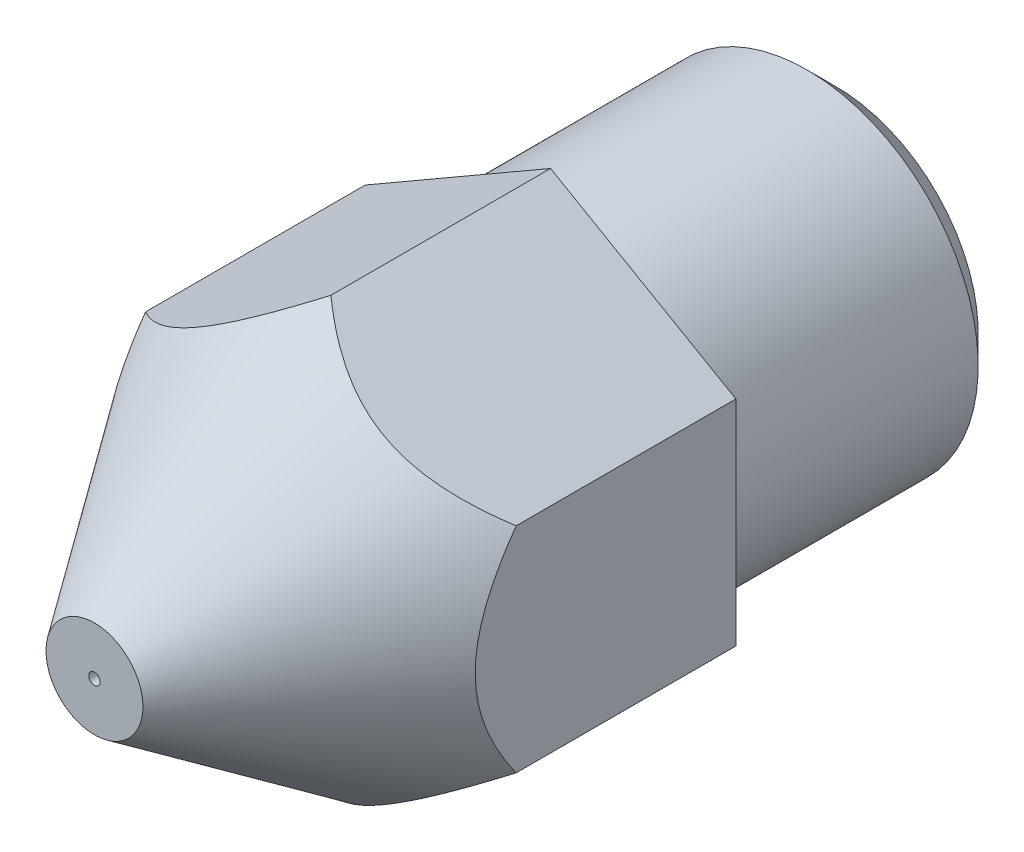
ISO-10303-21;
HEADER;
FILE_DESCRIPTION(('STEP AP214'),'2;1');
FILE_NAME('part.step','',(''),(''),'','','');
FILE_SCHEMA(('AUTOMOTIVE_DESIGN { 1 0 10303 214 1 1 1 1 }'));
ENDSEC;
DATA;
#1=APPLICATION_CONTEXT('core data for automotive mechanical design processes');
#2=APPLICATION_PROTOCOL_DEFINITION('international standard','automotive_design',2000,#1);
#3=PRODUCT_CONTEXT('',#1,'mechanical');
#4=PRODUCT('Part','Part','',(#3));
#5=PRODUCT_RELATED_PRODUCT_CATEGORY('part','',(#4));
#6=PRODUCT_DEFINITION_FORMATION('','',#4);
#7=PRODUCT_DEFINITION_CONTEXT('part definition',#1,'design');
#8=PRODUCT_DEFINITION('design','',#6,#7);
#9=PRODUCT_DEFINITION_SHAPE('','',#8);
#10=(LENGTH_UNIT() NAMED_UNIT(*) SI_UNIT(.MILLI.,.METRE.));
#11=(NAMED_UNIT(*) PLANE_ANGLE_UNIT() SI_UNIT($,.RADIAN.));
#12=(NAMED_UNIT(*) SI_UNIT($,.STERADIAN.) SOLID_ANGLE_UNIT());
#13=UNCERTAINTY_MEASURE_WITH_UNIT(LENGTH_MEASURE(1.E-05),#10,'distance_accuracy_value','');
#14=(GEOMETRIC_REPRESENTATION_CONTEXT(3) GLOBAL_UNCERTAINTY_ASSIGNED_CONTEXT((#13)) GLOBAL_UNIT_ASSIGNED_CONTEXT((#10,
#11,#12)) REPRESENTATION_CONTEXT('',''));
#15=CARTESIAN_POINT('',(0.,0.,0.));
#16=DIRECTION('',(0.,0.,1.));
#17=DIRECTION('',(1.,0.,0.));
#18=AXIS2_PLACEMENT_3D('',#15,#16,#17);
#19=CARTESIAN_POINT('',(-8.72088259015655,0.,-3.5));
#20=DIRECTION('',(0.,0.,-1.));
#21=DIRECTION('',(-1.,0.,0.));
#22=AXIS2_PLACEMENT_3D('',#19,#20,#21);
#23=PLANE('',#22);
#24=CARTESIAN_POINT('',(0.,0.,-3.5));
#25=DIRECTION('',(0.,0.,-1.));
#26=DIRECTION('',(-1.,0.,0.));
#27=AXIS2_PLACEMENT_3D('',#24,#25,#26);
#28=CIRCLE('',#27,3.);
#29=CARTESIAN_POINT('',(-3.,0.,-3.5));
#30=VERTEX_POINT('',#29);
#31=EDGE_CURVE('E178',#30,#30,#28,.T.);
#32=ORIENTED_EDGE('',*,*,#31,.F.);
#33=EDGE_LOOP('',(#32));
#34=FACE_BOUND('',#33,.T.);
#35=DIRECTION('',(0.866025403784438,-0.500000000000001,0.));
#36=VECTOR('',#35,1.);
#37=CARTESIAN_POINT('',(3.25,1.87638837486627,-3.5));
#38=LINE('',#37,#36);
#39=CARTESIAN_POINT('',(0.,3.75277674973256,-3.5));
#40=VERTEX_POINT('',#39);
#41=CARTESIAN_POINT('',(3.25,1.87638837486627,-3.5));
#42=VERTEX_POINT('',#41);
#43=EDGE_CURVE('E120',#40,#42,#38,.T.);
#44=ORIENTED_EDGE('',*,*,#43,.T.);
#45=DIRECTION('',(0.,-1.,0.));
#46=VECTOR('',#45,1.);
#47=CARTESIAN_POINT('',(3.25,1.87638837486627,-3.5));
#48=LINE('',#47,#46);
#49=CARTESIAN_POINT('',(3.25,-1.87638837486629,-3.5));
#50=VERTEX_POINT('',#49);
#51=EDGE_CURVE('E115',#42,#50,#48,.T.);
#52=ORIENTED_EDGE('',*,*,#51,.T.);
#53=DIRECTION('',(-0.866025403784439,-0.499999999999998,0.));
#54=VECTOR('',#53,1.);
#55=CARTESIAN_POINT('',(3.25,-1.87638837486629,-3.5));
#56=LINE('',#55,#54);
#57=CARTESIAN_POINT('',(0.,-3.75277674973256,-3.5));
#58=VERTEX_POINT('',#57);
#59=EDGE_CURVE('E113',#50,#58,#56,.T.);
#60=ORIENTED_EDGE('',*,*,#59,.T.);
#61=DIRECTION('',(-0.866025403784439,0.499999999999998,0.));
#62=VECTOR('',#61,1.);
#63=CARTESIAN_POINT('',(-3.25,-1.87638837486629,-3.5));
#64=LINE('',#63,#62);
#65=CARTESIAN_POINT('',(-3.25,-1.87638837486629,-3.5));
#66=VERTEX_POINT('',#65);
#67=EDGE_CURVE('E62',#58,#66,#64,.T.);
#68=ORIENTED_EDGE('',*,*,#67,.T.);
#69=DIRECTION('',(0.,1.,0.));
#70=VECTOR('',#69,1.);
#71=CARTESIAN_POINT('',(-3.25,1.87638837486627,-3.5));
#72=LINE('',#71,#70);
#73=CARTESIAN_POINT('',(-3.25,1.87638837486627,-3.5));
#74=VERTEX_POINT('',#73);
#75=EDGE_CURVE('E102',#66,#74,#72,.T.);
#76=ORIENTED_EDGE('',*,*,#75,.T.);
#77=DIRECTION('',(0.866025403784438,0.500000000000001,0.));
#78=VECTOR('',#77,1.);
#79=CARTESIAN_POINT('',(-3.25,1.87638837486627,-3.5));
#80=LINE('',#79,#78);
#81=EDGE_CURVE('E108',#74,#40,#80,.T.);
#82=ORIENTED_EDGE('',*,*,#81,.T.);
#83=EDGE_LOOP('',(#44,#52,#60,#68,#76,#82));
#84=FACE_BOUND('',#83,.T.);
#85=ADVANCED_FACE('F39',(#34,#84),#23,.T.);
#86=CARTESIAN_POINT('',(0.,0.,0.));
#87=DIRECTION('',(0.,0.,-1.));
#88=DIRECTION('',(-1.,0.,0.));
#89=AXIS2_PLACEMENT_3D('',#86,#87,#88);
#90=CYLINDRICAL_SURFACE('',#89,3.);
#91=CARTESIAN_POINT('',(0.,0.,-8.));
#92=DIRECTION('',(0.,0.,-1.));
#93=DIRECTION('',(-1.,0.,0.));
#94=AXIS2_PLACEMENT_3D('',#91,#92,#93);
#95=CIRCLE('',#94,3.);
#96=CARTESIAN_POINT('',(-3.,0.,-8.));
#97=VERTEX_POINT('',#96);
#98=EDGE_CURVE('E11',#97,#97,#95,.F.);
#99=ORIENTED_EDGE('',*,*,#98,.T.);
#100=EDGE_LOOP('',(#99));
#101=FACE_BOUND('',#100,.T.);
#102=ORIENTED_EDGE('',*,*,#31,.T.);
#103=EDGE_LOOP('',(#102));
#104=FACE_BOUND('',#103,.T.);
#105=ADVANCED_FACE('F201',(#101,#104),#90,.T.);
#106=CARTESIAN_POINT('',(-8.72088259015655,0.,-8.5));
#107=DIRECTION('',(0.,0.,-1.));
#108=DIRECTION('',(-1.,0.,0.));
#109=AXIS2_PLACEMENT_3D('',#106,#107,#108);
#110=PLANE('',#109);
#111=CARTESIAN_POINT('',(0.,0.,-8.5));
#112=DIRECTION('',(0.,0.,-1.));
#113=DIRECTION('',(-1.,0.,0.));
#114=AXIS2_PLACEMENT_3D('',#111,#112,#113);
#115=CIRCLE('',#114,2.5);
#116=CARTESIAN_POINT('',(-2.5,0.,-8.5));
#117=VERTEX_POINT('',#116);
#118=EDGE_CURVE('E47',#117,#117,#115,.T.);
#119=ORIENTED_EDGE('',*,*,#118,.T.);
#120=EDGE_LOOP('',(#119));
#121=FACE_BOUND('',#120,.T.);
#122=CARTESIAN_POINT('',(0.,0.,-8.5));
#123=DIRECTION('',(0.,0.,-1.));
#124=DIRECTION('',(-1.,0.,0.));
#125=AXIS2_PLACEMENT_3D('',#122,#123,#124);
#126=CIRCLE('',#125,0.999999999999999);
#127=CARTESIAN_POINT('',(-0.999999999999999,0.,-8.5));
#128=VERTEX_POINT('',#127);
#129=EDGE_CURVE('E175',#128,#128,#126,.T.);
#130=ORIENTED_EDGE('',*,*,#129,.F.);
#131=EDGE_LOOP('',(#130));
#132=FACE_BOUND('',#131,.T.);
#133=ADVANCED_FACE('F186',(#121,#132),#110,.T.);
#134=CARTESIAN_POINT('',(0.,0.,0.));
#135=DIRECTION('',(0.,0.,-1.));
#136=DIRECTION('',(-1.,0.,0.));
#137=AXIS2_PLACEMENT_3D('',#134,#135,#136);
#138=CYLINDRICAL_SURFACE('',#137,0.999999999999999);
#139=CARTESIAN_POINT('',(0.,0.,1.7679491924311));
#140=DIRECTION('',(0.,0.,-1.));
#141=DIRECTION('',(-1.,0.,0.));
#142=AXIS2_PLACEMENT_3D('',#139,#140,#141);
#143=CIRCLE('',#142,1.);
#144=CARTESIAN_POINT('',(-1.,0.,1.7679491924311));
#145=VERTEX_POINT('',#144);
#146=EDGE_CURVE('E166',#145,#145,#143,.T.);
#147=ORIENTED_EDGE('',*,*,#146,.F.);
#148=EDGE_LOOP('',(#147));
#149=FACE_BOUND('',#148,.T.);
#150=ORIENTED_EDGE('',*,*,#129,.T.);
#151=EDGE_LOOP('',(#150));
#152=FACE_BOUND('',#151,.T.);
#153=ADVANCED_FACE('F211',(#149,#152),#138,.F.);
#154=CARTESIAN_POINT('',(0.,0.,3.5));
#155=DIRECTION('',(0.,0.,-1.));
#156=DIRECTION('',(-1.,0.,0.));
#157=AXIS2_PLACEMENT_3D('',#154,#155,#156);
#158=CONICAL_SURFACE('',#157,0.,0.523598775598292);
#159=CARTESIAN_POINT('',(0.,0.,3.32679491924311));
#160=DIRECTION('',(0.,0.,-1.));
#161=DIRECTION('',(-1.,0.,0.));
#162=AXIS2_PLACEMENT_3D('',#159,#160,#161);
#163=CIRCLE('',#162,0.1);
#164=CARTESIAN_POINT('',(-0.1,0.,3.32679491924311));
#165=VERTEX_POINT('',#164);
#166=EDGE_CURVE('E226',#165,#165,#163,.T.);
#167=ORIENTED_EDGE('',*,*,#166,.F.);
#168=EDGE_LOOP('',(#167));
#169=FACE_BOUND('',#168,.T.);
#170=ORIENTED_EDGE('',*,*,#146,.T.);
#171=EDGE_LOOP('',(#170));
#172=FACE_BOUND('',#171,.T.);
#173=ADVANCED_FACE('F156',(#169,#172),#158,.F.);
#174=CARTESIAN_POINT('',(3.25,1.87638837486627,6.5));
#175=DIRECTION('',(1.,0.,0.));
#176=DIRECTION('',(0.,0.,-1.));
#177=AXIS2_PLACEMENT_3D('',#174,#175,#176);
#178=PLANE('',#177);
#179=CARTESIAN_POINT('',(3.25,-10.4210247445194,-9.88007856899838));
#180=CARTESIAN_POINT('',(3.25,-10.1550139917363,-9.51733888773863));
#181=CARTESIAN_POINT('',(3.25,-9.88845372005929,-9.15499987226475));
#182=CARTESIAN_POINT('',(3.25,-9.35381845633714,-8.43138045471311));
#183=CARTESIAN_POINT('',(3.25,-9.08574330243901,-8.07010017226316));
#184=CARTESIAN_POINT('',(3.25,-8.5465114504986,-7.34731421528531));
#185=CARTESIAN_POINT('',(3.25,-8.27534631806567,-6.98581482421531));
#186=CARTESIAN_POINT('',(3.25,-7.73055095092707,-6.26472775277727));
#187=CARTESIAN_POINT('',(3.25,-7.45692093696118,-5.90513990572012));
#188=CARTESIAN_POINT('',(3.25,-6.87641455651948,-5.14958529105867));
#189=CARTESIAN_POINT('',(3.25,-6.56915612701844,-4.75391082353562));
#190=CARTESIAN_POINT('',(3.25,-6.10374655484884,-4.16386703706671));
#191=CARTESIAN_POINT('',(3.25,-5.94783218566263,-3.96773403080044));
#192=CARTESIAN_POINT('',(3.25,-5.63415525030047,-3.57695354048657));
#193=CARTESIAN_POINT('',(3.25,-5.4763927096676,-3.3823060359695));
#194=CARTESIAN_POINT('',(3.25,-5.15893896824526,-2.9953516604686));
#195=CARTESIAN_POINT('',(3.25,-4.99925317084272,-2.8030403640479));
#196=CARTESIAN_POINT('',(3.25,-4.67697917481462,-2.42086687340566));
#197=CARTESIAN_POINT('',(3.25,-4.51439105903881,-2.23100460953955));
#198=CARTESIAN_POINT('',(3.25,-4.18553282288161,-1.85464887331366));
#199=CARTESIAN_POINT('',(3.25,-4.01926450825844,-1.66815382690139));
#200=CARTESIAN_POINT('',(3.25,-3.6817798349018,-1.29970882436992));
#201=CARTESIAN_POINT('',(3.25,-3.51056428599971,-1.1177581333577));
#202=CARTESIAN_POINT('',(3.25,-3.26393070137451,-0.865405696541));
#203=CARTESIAN_POINT('',(3.25,-3.19131776621961,-0.79226068358926));
#204=CARTESIAN_POINT('',(3.25,-3.04475880052872,-0.647310082864942));
#205=CARTESIAN_POINT('',(3.25,-2.97081272298776,-0.575504542502851));
#206=CARTESIAN_POINT('',(3.25,-2.82132836383633,-0.433432996749373));
#207=CARTESIAN_POINT('',(3.25,-2.74578873286427,-0.363168408007898));
#208=CARTESIAN_POINT('',(3.25,-2.59294548593326,-0.22458265578279));
#209=CARTESIAN_POINT('',(3.25,-2.51564191392236,-0.156261443975585));
#210=CARTESIAN_POINT('',(3.25,-2.35962863128407,-0.0225418631250678));
#211=CARTESIAN_POINT('',(3.25,-2.28093549668624,0.0428757763280561));
#212=CARTESIAN_POINT('',(3.25,-2.12123029837015,0.170812712160738));
#213=CARTESIAN_POINT('',(3.25,-2.04021848242268,0.233332316363522));
#214=CARTESIAN_POINT('',(3.25,-1.87560781430329,0.354678882841892));
#215=CARTESIAN_POINT('',(3.25,-1.79201214397981,0.413510136233417));
#216=CARTESIAN_POINT('',(3.25,-1.62178865576906,0.526580156933862));
#217=CARTESIAN_POINT('',(3.25,-1.53516194986874,0.580820584007462));
#218=CARTESIAN_POINT('',(3.25,-1.36359261683321,0.680500894316108));
#219=CARTESIAN_POINT('',(3.25,-1.27884180990056,0.726268165597498));
#220=CARTESIAN_POINT('',(3.25,-1.10607956257896,0.811279714200296));
#221=CARTESIAN_POINT('',(3.25,-1.01806782954458,0.850523404333303));
#222=CARTESIAN_POINT('',(3.25,-0.839332144532956,0.920658513948042));
#223=CARTESIAN_POINT('',(3.25,-0.748627228266093,0.951597782491711));
#224=CARTESIAN_POINT('',(3.25,-0.564445767595396,1.00368567339653));
#225=CARTESIAN_POINT('',(3.25,-0.470971158677318,1.02484096884422));
#226=CARTESIAN_POINT('',(3.25,-0.31021269480558,1.05127993409116));
#227=CARTESIAN_POINT('',(3.25,-0.243391087655944,1.05941089272303));
#228=CARTESIAN_POINT('',(3.25,-0.10929692359172,1.06978719391885));
#229=CARTESIAN_POINT('',(3.25,-0.0420244717026198,1.07203386252287));
#230=CARTESIAN_POINT('',(3.25,0.0924859824112476,1.07054346454063));
#231=CARTESIAN_POINT('',(3.25,0.159723951184364,1.06680344045537));
#232=CARTESIAN_POINT('',(3.25,0.293622107986032,1.05349619513517));
#233=CARTESIAN_POINT('',(3.25,0.360282201737024,1.04392804056198));
#234=CARTESIAN_POINT('',(3.25,0.508077283596723,1.01645864781881));
#235=CARTESIAN_POINT('',(3.25,0.588947438494196,0.997130940009136));
#236=CARTESIAN_POINT('',(3.25,0.748591314579006,0.951169900880214));
#237=CARTESIAN_POINT('',(3.25,0.827363941289588,0.924532834472439));
#238=CARTESIAN_POINT('',(3.25,0.982756746605189,0.86498782867529));
#239=CARTESIAN_POINT('',(3.25,1.05936949097002,0.832060694820526));
#240=CARTESIAN_POINT('',(3.25,1.21013939239264,0.761061461579138));
#241=CARTESIAN_POINT('',(3.25,1.28429673132708,0.722989744328012));
#242=CARTESIAN_POINT('',(3.25,1.45103081353316,0.631200477331062));
#243=CARTESIAN_POINT('',(3.25,1.54284959389495,0.576112203216525));
#244=CARTESIAN_POINT('',(3.25,1.72304533999821,0.460540297034056));
#245=CARTESIAN_POINT('',(3.25,1.81142065906605,0.400054128083826));
#246=CARTESIAN_POINT('',(3.25,1.98528352415769,0.274783953130044));
#247=CARTESIAN_POINT('',(3.25,2.07076582073379,0.20999270685187));
#248=CARTESIAN_POINT('',(3.25,2.23911308770666,0.0770901423910738));
#249=CARTESIAN_POINT('',(3.25,2.32197769933942,0.00897837234307475));
#250=CARTESIAN_POINT('',(3.25,2.48653368269928,-0.130809444597796));
#251=CARTESIAN_POINT('',(3.25,2.56819498510862,-0.202520747732826));
#252=CARTESIAN_POINT('',(3.25,2.72953550153858,-0.348137152915524));
#253=CARTESIAN_POINT('',(3.25,2.80921465145204,-0.422042325748644));
#254=CARTESIAN_POINT('',(3.25,2.96677477901546,-0.57155651004705));
#255=CARTESIAN_POINT('',(3.25,3.04465777148272,-0.647163403504268));
#256=CARTESIAN_POINT('',(3.25,3.19894935244089,-0.799857479381094));
#257=CARTESIAN_POINT('',(3.25,3.27535799486935,-0.876944607441244));
#258=CARTESIAN_POINT('',(3.25,3.52045427106936,-1.12827865568185));
#259=CARTESIAN_POINT('',(3.25,3.68661538469058,-1.3049903624906));
#260=CARTESIAN_POINT('',(3.25,4.01427116135899,-1.66270002440727));
#261=CARTESIAN_POINT('',(3.25,4.17576512723189,-1.84369861261292));
#262=CARTESIAN_POINT('',(3.25,4.49525237699607,-2.2088932701784));
#263=CARTESIAN_POINT('',(3.25,4.65324408250668,-2.39309071707174));
#264=CARTESIAN_POINT('',(3.25,4.96645230193129,-2.76383425544363));
#265=CARTESIAN_POINT('',(3.25,5.12166871810462,-2.95038042924734));
#266=CARTESIAN_POINT('',(3.25,5.43025696832106,-3.3257192462737));
#267=CARTESIAN_POINT('',(3.25,5.58362365431564,-3.51451611505904));
#268=CARTESIAN_POINT('',(3.25,5.88857051821366,-3.89354844509705));
#269=CARTESIAN_POINT('',(3.25,6.04015067551032,-4.08378392290193));
#270=CARTESIAN_POINT('',(3.25,6.49263276349124,-4.65609992811039));
#271=CARTESIAN_POINT('',(3.25,6.7913632970303,-5.03989668290531));
#272=CARTESIAN_POINT('',(3.25,7.35168819682291,-5.76754267052628));
#273=CARTESIAN_POINT('',(3.25,7.61370505420361,-6.11106794146315));
#274=CARTESIAN_POINT('',(3.25,8.13537826760183,-6.79994900303737));
#275=CARTESIAN_POINT('',(3.25,8.39503443121531,-7.14530493931204));
#276=CARTESIAN_POINT('',(3.25,8.91140905048834,-7.8358847368182));
#277=CARTESIAN_POINT('',(3.25,9.16813534621361,-8.18110274401208));
#278=CARTESIAN_POINT('',(3.25,9.68012114769552,-8.87257138198324));
#279=CARTESIAN_POINT('',(3.25,9.93538079836424,-9.21882190542288));
#280=CARTESIAN_POINT('',(3.25,10.1901025523241,-9.5654654608227));
#281=B_SPLINE_CURVE_WITH_KNOTS('',3,(#179,#180,#181,#182,#183,#184,#185,#186,#187,#188,#189,
#190,#191,#192,#193,#194,#195,#196,#197,#198,#199,#200,#201,#202,#203,#204,#205,#206,#207,#208,
#209,#210,#211,#212,#213,#214,#215,#216,#217,#218,#219,#220,#221,#222,#223,#224,#225,#226,#227,
#228,#229,#230,#231,#232,#233,#234,#235,#236,#237,#238,#239,#240,#241,#242,#243,#244,#245,#246,
#247,#248,#249,#250,#251,#252,#253,#254,#255,#256,#257,#258,#259,#260,#261,#262,#263,#264,#265,
#266,#267,#268,#269,#270,#271,#272,#273,#274,#275,#276,#277,#278,#279,#280),.UNSPECIFIED.,.F.,
.F.,(4,2,2,2,2,2,2,2,2,2,2,2,2,2,2,2,2,2,2,2,2,2,2,2,2,2,2,2,2,2,2,2,2,2,2,2,2,2,2,2,2,2,2,2,2,
2,2,2,2,2,4),(0.,1.34947476346116,2.6990965413674,4.05478349288121,5.41035022098572,
6.91319924459299,7.66485369747403,8.41649777416657,9.16637554585059,9.91623194560435,
10.6657282314788,11.4151025168822,11.7242903697911,12.0334891456848,12.3429611768772,
12.6524255060691,12.9593698715412,13.2662815589661,13.572829285287,13.8792657048433,
14.1679991521169,14.4567585742705,14.7438166312515,15.0306786126203,15.2323856361125,
15.4340472004895,15.6358084188816,15.8376019565551,16.0866383217799,16.3358021825467,
16.5857388896212,16.8356570417937,17.1566345241216,17.4777636607688,17.7994472548494,
18.1211747473211,18.4471628340489,18.7731614502756,19.0987745945141,19.424375803867,
20.1519280197861,20.8795883608536,21.6075702337514,22.3355776945511,23.0652835436712,
23.7949978013873,25.2540134756318,26.5501364635593,27.8463641592974,29.1370015087049,
30.4275090645206),.UNSPECIFIED.);
#282=CARTESIAN_POINT('',(3.25,1.87638837486627,0.353176071810624));
#283=VERTEX_POINT('',#282);
#284=CARTESIAN_POINT('',(3.25,-1.87638837486629,0.353176071810615));
#285=VERTEX_POINT('',#284);
#286=EDGE_CURVE('E160',#283,#285,#281,.F.);
#287=ORIENTED_EDGE('',*,*,#286,.T.);
#288=DIRECTION('',(0.,0.,-1.));
#289=VECTOR('',#288,1.);
#290=CARTESIAN_POINT('',(3.25,-1.87638837486629,6.5));
#291=LINE('',#290,#289);
#292=EDGE_CURVE('E54',#285,#50,#291,.T.);
#293=ORIENTED_EDGE('',*,*,#292,.T.);
#294=ORIENTED_EDGE('',*,*,#51,.F.);
#295=DIRECTION('',(0.,0.,-1.));
#296=VECTOR('',#295,1.);
#297=CARTESIAN_POINT('',(3.25,1.87638837486627,6.5));
#298=LINE('',#297,#296);
#299=EDGE_CURVE('E122',#283,#42,#298,.T.);
#300=ORIENTED_EDGE('',*,*,#299,.F.);
#301=EDGE_LOOP('',(#287,#293,#294,#300));
#302=FACE_BOUND('',#301,.T.);
#303=ADVANCED_FACE('F151',(#302),#178,.T.);
#304=CARTESIAN_POINT('',(3.25,1.87638837486627,6.5));
#305=DIRECTION('',(0.500000000000001,0.866025403784438,0.));
#306=DIRECTION('',(-0.866025403784438,0.500000000000001,0.));
#307=AXIS2_PLACEMENT_3D('',#304,#305,#306);
#308=PLANE('',#307);
#309=CARTESIAN_POINT('',(-0.00019999999999998,3.7528922197864,0.353011106977677));
#310=CARTESIAN_POINT('',(0.0696924760585749,3.71253977991966,0.410613756754915));
#311=CARTESIAN_POINT('',(0.140732963459875,3.67152453539515,0.466468702287997));
#312=CARTESIAN_POINT('',(0.285650233103082,3.58785651075642,0.573685388217752));
#313=CARTESIAN_POINT('',(0.359536007165287,3.54519853921232,0.625030853673703));
#314=CARTESIAN_POINT('',(0.511798860795695,3.45728953968123,0.722839472228576));
#315=CARTESIAN_POINT('',(0.590237930434609,3.41200272171021,0.769176139046382));
#316=CARTESIAN_POINT('',(0.750144408050631,3.31968067381344,0.853921370951946));
#317=CARTESIAN_POINT('',(0.831607549638905,3.27264790708842,0.892340639215073));
#318=CARTESIAN_POINT('',(1.0278790506324,3.15933050315557,0.971525661471434));
#319=CARTESIAN_POINT('',(1.14404608904675,3.09226143225608,1.00806952115924));
#320=CARTESIAN_POINT('',(1.32043627578567,2.99042251045996,1.04531237413983));
#321=CARTESIAN_POINT('',(1.37932054816664,2.95642565994977,1.05479402211398));
#322=CARTESIAN_POINT('',(1.49759750266951,2.88813842842861,1.06769130783919));
#323=CARTESIAN_POINT('',(1.55699015004808,2.85384806747671,1.07110735685107));
#324=CARTESIAN_POINT('',(1.67596229605911,2.78515946695117,1.07170720821418));
#325=CARTESIAN_POINT('',(1.73554186081175,2.75076118920304,1.06887391054682));
#326=CARTESIAN_POINT('',(1.85423259473233,2.68223506202367,1.05708334674088));
#327=CARTESIAN_POINT('',(1.91334373096993,2.64810723160479,1.04812565385585));
#328=CARTESIAN_POINT('',(2.09046648052649,2.5458453644687,1.01234646240549));
#329=CARTESIAN_POINT('',(2.20718329898305,2.47845887791385,0.976622664700296));
#330=CARTESIAN_POINT('',(2.40539160789344,2.36402325740882,0.898184572275519));
#331=CARTESIAN_POINT('',(2.48820343613702,2.3162118260803,0.859650380228274));
#332=CARTESIAN_POINT('',(2.65072151526336,2.22238196934853,0.774359526769053));
#333=CARTESIAN_POINT('',(2.73042307679968,2.1763662513407,0.727590994350096));
#334=CARTESIAN_POINT('',(2.8850880350143,2.08707039608128,0.628705360068665));
#335=CARTESIAN_POINT('',(2.96011544004436,2.04375330359058,0.576719418243305));
#336=CARTESIAN_POINT('',(3.10721601496487,1.95882474706228,0.46807920989213));
#337=CARTESIAN_POINT('',(3.17929900168905,1.91720761527308,0.411442745491607));
#338=CARTESIAN_POINT('',(3.2502,1.87627290481244,0.35301110697768));
#339=B_SPLINE_CURVE_WITH_KNOTS('',3,(#309,#310,#311,#312,#313,#314,#315,#316,#317,#318,#319,
#320,#321,#322,#323,#324,#325,#326,#327,#328,#329,#330,#331,#332,#333,#334,#335,#336,#337,#338),
.UNSPECIFIED.,.F.,.F.,(4,2,2,2,2,2,2,2,2,2,2,2,2,2,4),(0.,0.297528461773674,0.596090016316984,
0.900977038685541,1.20544915439333,1.62057804961722,1.82630352318148,2.03201504757745,
2.23829015627292,2.4445796396355,2.86086238799738,3.1697665296011,3.4791197036515,
3.78205208298373,4.08387454941209),.UNSPECIFIED.);
#340=CARTESIAN_POINT('',(0.,3.75277674973256,0.353176071810623));
#341=VERTEX_POINT('',#340);
#342=EDGE_CURVE('E167',#341,#283,#339,.T.);
#343=ORIENTED_EDGE('',*,*,#342,.T.);
#344=ORIENTED_EDGE('',*,*,#299,.T.);
#345=ORIENTED_EDGE('',*,*,#43,.F.);
#346=DIRECTION('',(0.,0.,-1.));
#347=VECTOR('',#346,1.);
#348=CARTESIAN_POINT('',(0.,3.75277674973256,6.5));
#349=LINE('',#348,#347);
#350=EDGE_CURVE('E125',#341,#40,#349,.T.);
#351=ORIENTED_EDGE('',*,*,#350,.F.);
#352=EDGE_LOOP('',(#343,#344,#345,#351));
#353=FACE_BOUND('',#352,.T.);
#354=ADVANCED_FACE('F155',(#353),#308,.T.);
#355=CARTESIAN_POINT('',(-3.25,1.87638837486627,6.5));
#356=DIRECTION('',(-0.500000000000001,0.866025403784438,0.));
#357=DIRECTION('',(-0.866025403784438,-0.500000000000001,0.));
#358=AXIS2_PLACEMENT_3D('',#355,#356,#357);
#359=PLANE('',#358);
#360=CARTESIAN_POINT('',(-3.2502,1.87627290481244,0.35301110697768));
#361=CARTESIAN_POINT('',(-3.18030752394143,1.91662534467918,0.410613756754918));
#362=CARTESIAN_POINT('',(-3.10926703654012,1.95764058920369,0.466468702287999));
#363=CARTESIAN_POINT('',(-2.96434976689692,2.04130861384242,0.573685388217755));
#364=CARTESIAN_POINT('',(-2.89046399283471,2.08396658538652,0.625030853673706));
#365=CARTESIAN_POINT('',(-2.73820113920431,2.17187558491761,0.722839472228578));
#366=CARTESIAN_POINT('',(-2.65976206956539,2.21716240288862,0.769176139046383));
#367=CARTESIAN_POINT('',(-2.49985559194937,2.3094844507854,0.853921370951946));
#368=CARTESIAN_POINT('',(-2.41839245036109,2.35651721751042,0.892340639215073));
#369=CARTESIAN_POINT('',(-2.2221209493676,2.46983462144327,0.971525661471434));
#370=CARTESIAN_POINT('',(-2.10595391095325,2.53690369234276,1.00806952115924));
#371=CARTESIAN_POINT('',(-1.92956372421433,2.63874261413888,1.04531237413983));
#372=CARTESIAN_POINT('',(-1.87067945183336,2.67273946464907,1.05479402211398));
#373=CARTESIAN_POINT('',(-1.75240249733049,2.74102669617023,1.06769130783918));
#374=CARTESIAN_POINT('',(-1.69300984995192,2.77531705712213,1.07110735685107));
#375=CARTESIAN_POINT('',(-1.57403770394089,2.84400565764767,1.07170720821418));
#376=CARTESIAN_POINT('',(-1.51445813918825,2.8784039353958,1.06887391054682));
#377=CARTESIAN_POINT('',(-1.39576740526767,2.94693006257517,1.05708334674088));
#378=CARTESIAN_POINT('',(-1.33665626903007,2.98105789299405,1.04812565385586));
#379=CARTESIAN_POINT('',(-1.15953351947351,3.08331976013014,1.01234646240549));
#380=CARTESIAN_POINT('',(-1.04281670101695,3.15070624668499,0.976622664700295));
#381=CARTESIAN_POINT('',(-0.844608392106559,3.26514186719002,0.898184572275517));
#382=CARTESIAN_POINT('',(-0.761796563862977,3.31295329851854,0.859650380228273));
#383=CARTESIAN_POINT('',(-0.599278484736643,3.40678315525031,0.774359526769051));
#384=CARTESIAN_POINT('',(-0.519576923200323,3.45279887325814,0.727590994350094));
#385=CARTESIAN_POINT('',(-0.364911964985697,3.54209472851756,0.628705360068663));
#386=CARTESIAN_POINT('',(-0.289884559955637,3.58541182100826,0.576719418243302));
#387=CARTESIAN_POINT('',(-0.142783985035131,3.67034037753656,0.468079209892127));
#388=CARTESIAN_POINT('',(-0.0707009983109482,3.71195750932576,0.411442745491604));
#389=CARTESIAN_POINT('',(0.000199999999999989,3.7528922197864,0.353011106977678));
#390=B_SPLINE_CURVE_WITH_KNOTS('',3,(#360,#361,#362,#363,#364,#365,#366,#367,#368,#369,#370,
#371,#372,#373,#374,#375,#376,#377,#378,#379,#380,#381,#382,#383,#384,#385,#386,#387,#388,#389),
.UNSPECIFIED.,.F.,.F.,(4,2,2,2,2,2,2,2,2,2,2,2,2,2,4),(0.,0.297528461773675,0.596090016316983,
0.90097703868554,1.20544915439333,1.62057804961722,1.82630352318148,2.03201504757745,
2.23829015627292,2.4445796396355,2.86086238799738,3.16976652960109,3.4791197036515,
3.78205208298373,4.08387454941209),.UNSPECIFIED.);
#391=CARTESIAN_POINT('',(-3.25,1.87638837486627,0.353176071810624));
#392=VERTEX_POINT('',#391);
#393=EDGE_CURVE('E247',#392,#341,#390,.T.);
#394=ORIENTED_EDGE('',*,*,#393,.T.);
#395=ORIENTED_EDGE('',*,*,#350,.T.);
#396=ORIENTED_EDGE('',*,*,#81,.F.);
#397=DIRECTION('',(0.,0.,-1.));
#398=VECTOR('',#397,1.);
#399=CARTESIAN_POINT('',(-3.25,1.87638837486627,6.5));
#400=LINE('',#399,#398);
#401=EDGE_CURVE('E98',#392,#74,#400,.T.);
#402=ORIENTED_EDGE('',*,*,#401,.F.);
#403=EDGE_LOOP('',(#394,#395,#396,#402));
#404=FACE_BOUND('',#403,.T.);
#405=ADVANCED_FACE('F257',(#404),#359,.T.);
#406=CARTESIAN_POINT('',(-3.25,1.87638837486627,6.5));
#407=DIRECTION('',(-1.,0.,0.));
#408=DIRECTION('',(0.,0.,1.));
#409=AXIS2_PLACEMENT_3D('',#406,#407,#408);
#410=PLANE('',#409);
#411=CARTESIAN_POINT('',(-3.25,-10.4210247445194,-9.88007856899838));
#412=CARTESIAN_POINT('',(-3.25,-10.1550139917363,-9.51733888773863));
#413=CARTESIAN_POINT('',(-3.25,-9.88845372005929,-9.15499987226475));
#414=CARTESIAN_POINT('',(-3.25,-9.35381845633714,-8.43138045471311));
#415=CARTESIAN_POINT('',(-3.25,-9.08574330243901,-8.07010017226316));
#416=CARTESIAN_POINT('',(-3.25,-8.5465114504986,-7.34731421528531));
#417=CARTESIAN_POINT('',(-3.25,-8.27534631806567,-6.98581482421531));
#418=CARTESIAN_POINT('',(-3.25,-7.73055095092707,-6.26472775277727));
#419=CARTESIAN_POINT('',(-3.25,-7.45692093696118,-5.90513990572012));
#420=CARTESIAN_POINT('',(-3.25,-6.87641455651948,-5.14958529105867));
#421=CARTESIAN_POINT('',(-3.25,-6.56915612701844,-4.75391082353562));
#422=CARTESIAN_POINT('',(-3.25,-6.10374655484884,-4.16386703706671));
#423=CARTESIAN_POINT('',(-3.25,-5.94783218566263,-3.96773403080044));
#424=CARTESIAN_POINT('',(-3.25,-5.63415525030047,-3.57695354048657));
#425=CARTESIAN_POINT('',(-3.25,-5.4763927096676,-3.3823060359695));
#426=CARTESIAN_POINT('',(-3.25,-5.15893896824526,-2.9953516604686));
#427=CARTESIAN_POINT('',(-3.25,-4.99925317084272,-2.8030403640479));
#428=CARTESIAN_POINT('',(-3.25,-4.67697917481462,-2.42086687340566));
#429=CARTESIAN_POINT('',(-3.25,-4.51439105903881,-2.23100460953955));
#430=CARTESIAN_POINT('',(-3.25,-4.18553282288161,-1.85464887331366));
#431=CARTESIAN_POINT('',(-3.25,-4.01926450825844,-1.66815382690139));
#432=CARTESIAN_POINT('',(-3.25,-3.6817798349018,-1.29970882436992));
#433=CARTESIAN_POINT('',(-3.25,-3.51056428599971,-1.1177581333577));
#434=CARTESIAN_POINT('',(-3.25,-3.26393070137451,-0.865405696541));
#435=CARTESIAN_POINT('',(-3.25,-3.19131776621961,-0.79226068358926));
#436=CARTESIAN_POINT('',(-3.25,-3.04475880052872,-0.647310082864942));
#437=CARTESIAN_POINT('',(-3.25,-2.97081272298776,-0.575504542502851));
#438=CARTESIAN_POINT('',(-3.25,-2.82132836383633,-0.433432996749373));
#439=CARTESIAN_POINT('',(-3.25,-2.74578873286427,-0.363168408007898));
#440=CARTESIAN_POINT('',(-3.25,-2.59294548593326,-0.22458265578279));
#441=CARTESIAN_POINT('',(-3.25,-2.51564191392236,-0.156261443975585));
#442=CARTESIAN_POINT('',(-3.25,-2.35962863128407,-0.0225418631250678));
#443=CARTESIAN_POINT('',(-3.25,-2.28093549668624,0.0428757763280561));
#444=CARTESIAN_POINT('',(-3.25,-2.12123029837015,0.170812712160738));
#445=CARTESIAN_POINT('',(-3.25,-2.04021848242268,0.233332316363522));
#446=CARTESIAN_POINT('',(-3.25,-1.87560781430329,0.354678882841892));
#447=CARTESIAN_POINT('',(-3.25,-1.79201214397981,0.413510136233417));
#448=CARTESIAN_POINT('',(-3.25,-1.62178865576906,0.526580156933862));
#449=CARTESIAN_POINT('',(-3.25,-1.53516194986874,0.580820584007462));
#450=CARTESIAN_POINT('',(-3.25,-1.36359261683321,0.680500894316108));
#451=CARTESIAN_POINT('',(-3.25,-1.27884180990056,0.726268165597498));
#452=CARTESIAN_POINT('',(-3.25,-1.10607956257896,0.811279714200296));
#453=CARTESIAN_POINT('',(-3.25,-1.01806782954458,0.850523404333303));
#454=CARTESIAN_POINT('',(-3.25,-0.839332144532956,0.920658513948042));
#455=CARTESIAN_POINT('',(-3.25,-0.748627228266093,0.951597782491711));
#456=CARTESIAN_POINT('',(-3.25,-0.564445767595396,1.00368567339653));
#457=CARTESIAN_POINT('',(-3.25,-0.470971158677318,1.02484096884422));
#458=CARTESIAN_POINT('',(-3.25,-0.31021269480558,1.05127993409116));
#459=CARTESIAN_POINT('',(-3.25,-0.243391087655944,1.05941089272303));
#460=CARTESIAN_POINT('',(-3.25,-0.10929692359172,1.06978719391885));
#461=CARTESIAN_POINT('',(-3.25,-0.0420244717026198,1.07203386252287));
#462=CARTESIAN_POINT('',(-3.25,0.0924859824112476,1.07054346454063));
#463=CARTESIAN_POINT('',(-3.25,0.159723951184364,1.06680344045537));
#464=CARTESIAN_POINT('',(-3.25,0.293622107986032,1.05349619513517));
#465=CARTESIAN_POINT('',(-3.25,0.360282201737024,1.04392804056198));
#466=CARTESIAN_POINT('',(-3.25,0.508077283596723,1.01645864781881));
#467=CARTESIAN_POINT('',(-3.25,0.588947438494196,0.997130940009136));
#468=CARTESIAN_POINT('',(-3.25,0.748591314579006,0.951169900880214));
#469=CARTESIAN_POINT('',(-3.25,0.827363941289588,0.924532834472439));
#470=CARTESIAN_POINT('',(-3.25,0.982756746605189,0.86498782867529));
#471=CARTESIAN_POINT('',(-3.25,1.05936949097002,0.832060694820526));
#472=CARTESIAN_POINT('',(-3.25,1.21013939239264,0.761061461579138));
#473=CARTESIAN_POINT('',(-3.25,1.28429673132708,0.722989744328012));
#474=CARTESIAN_POINT('',(-3.25,1.45103081353316,0.631200477331062));
#475=CARTESIAN_POINT('',(-3.25,1.54284959389495,0.576112203216525));
#476=CARTESIAN_POINT('',(-3.25,1.72304533999821,0.460540297034056));
#477=CARTESIAN_POINT('',(-3.25,1.81142065906605,0.400054128083826));
#478=CARTESIAN_POINT('',(-3.25,1.98528352415769,0.274783953130044));
#479=CARTESIAN_POINT('',(-3.25,2.07076582073379,0.20999270685187));
#480=CARTESIAN_POINT('',(-3.25,2.23911308770666,0.0770901423910738));
#481=CARTESIAN_POINT('',(-3.25,2.32197769933942,0.00897837234307475));
#482=CARTESIAN_POINT('',(-3.25,2.48653368269928,-0.130809444597796));
#483=CARTESIAN_POINT('',(-3.25,2.56819498510862,-0.202520747732826));
#484=CARTESIAN_POINT('',(-3.25,2.72953550153858,-0.348137152915524));
#485=CARTESIAN_POINT('',(-3.25,2.80921465145204,-0.422042325748644));
#486=CARTESIAN_POINT('',(-3.25,2.96677477901546,-0.57155651004705));
#487=CARTESIAN_POINT('',(-3.25,3.04465777148272,-0.647163403504268));
#488=CARTESIAN_POINT('',(-3.25,3.19894935244089,-0.799857479381094));
#489=CARTESIAN_POINT('',(-3.25,3.27535799486935,-0.876944607441244));
#490=CARTESIAN_POINT('',(-3.25,3.52045427106936,-1.12827865568185));
#491=CARTESIAN_POINT('',(-3.25,3.68661538469058,-1.3049903624906));
#492=CARTESIAN_POINT('',(-3.25,4.01427116135899,-1.66270002440727));
#493=CARTESIAN_POINT('',(-3.25,4.17576512723189,-1.84369861261292));
#494=CARTESIAN_POINT('',(-3.25,4.49525237699607,-2.2088932701784));
#495=CARTESIAN_POINT('',(-3.25,4.65324408250668,-2.39309071707174));
#496=CARTESIAN_POINT('',(-3.25,4.96645230193129,-2.76383425544363));
#497=CARTESIAN_POINT('',(-3.25,5.12166871810462,-2.95038042924734));
#498=CARTESIAN_POINT('',(-3.25,5.43025696832106,-3.3257192462737));
#499=CARTESIAN_POINT('',(-3.25,5.58362365431564,-3.51451611505904));
#500=CARTESIAN_POINT('',(-3.25,5.88857051821366,-3.89354844509705));
#501=CARTESIAN_POINT('',(-3.25,6.04015067551032,-4.08378392290193));
#502=CARTESIAN_POINT('',(-3.25,6.49263276349124,-4.65609992811039));
#503=CARTESIAN_POINT('',(-3.25,6.7913632970303,-5.03989668290531));
#504=CARTESIAN_POINT('',(-3.25,7.35168819682291,-5.76754267052628));
#505=CARTESIAN_POINT('',(-3.25,7.61370505420361,-6.11106794146315));
#506=CARTESIAN_POINT('',(-3.25,8.13537826760183,-6.79994900303737));
#507=CARTESIAN_POINT('',(-3.25,8.39503443121531,-7.14530493931204));
#508=CARTESIAN_POINT('',(-3.25,8.91140905048834,-7.8358847368182));
#509=CARTESIAN_POINT('',(-3.25,9.16813534621361,-8.18110274401208));
#510=CARTESIAN_POINT('',(-3.25,9.68012114769552,-8.87257138198324));
#511=CARTESIAN_POINT('',(-3.25,9.93538079836424,-9.21882190542288));
#512=CARTESIAN_POINT('',(-3.25,10.1901025523241,-9.5654654608227));
#513=B_SPLINE_CURVE_WITH_KNOTS('',3,(#411,#412,#413,#414,#415,#416,#417,#418,#419,#420,#421,
#422,#423,#424,#425,#426,#427,#428,#429,#430,#431,#432,#433,#434,#435,#436,#437,#438,#439,#440,
#441,#442,#443,#444,#445,#446,#447,#448,#449,#450,#451,#452,#453,#454,#455,#456,#457,#458,#459,
#460,#461,#462,#463,#464,#465,#466,#467,#468,#469,#470,#471,#472,#473,#474,#475,#476,#477,#478,
#479,#480,#481,#482,#483,#484,#485,#486,#487,#488,#489,#490,#491,#492,#493,#494,#495,#496,#497,
#498,#499,#500,#501,#502,#503,#504,#505,#506,#507,#508,#509,#510,#511,#512),.UNSPECIFIED.,.F.,
.F.,(4,2,2,2,2,2,2,2,2,2,2,2,2,2,2,2,2,2,2,2,2,2,2,2,2,2,2,2,2,2,2,2,2,2,2,2,2,2,2,2,2,2,2,2,2,
2,2,2,2,2,4),(0.,1.34947476346116,2.6990965413674,4.05478349288121,5.41035022098572,
6.91319924459299,7.66485369747403,8.41649777416657,9.16637554585059,9.91623194560435,
10.6657282314788,11.4151025168822,11.7242903697911,12.0334891456848,12.3429611768772,
12.6524255060691,12.9593698715412,13.2662815589661,13.572829285287,13.8792657048433,
14.1679991521169,14.4567585742705,14.7438166312515,15.0306786126203,15.2323856361125,
15.4340472004895,15.6358084188816,15.8376019565551,16.0866383217799,16.3358021825467,
16.5857388896212,16.8356570417937,17.1566345241216,17.4777636607688,17.7994472548494,
18.1211747473211,18.4471628340489,18.7731614502756,19.0987745945141,19.424375803867,
20.1519280197861,20.8795883608536,21.6075702337514,22.3355776945511,23.0652835436712,
23.7949978013873,25.2540134756318,26.5501364635593,27.8463641592974,29.1370015087049,
30.4275090645206),.UNSPECIFIED.);
#514=CARTESIAN_POINT('',(-3.25,-1.87638837486629,0.353176071810614));
#515=VERTEX_POINT('',#514);
#516=EDGE_CURVE('E248',#515,#392,#513,.T.);
#517=ORIENTED_EDGE('',*,*,#516,.T.);
#518=ORIENTED_EDGE('',*,*,#401,.T.);
#519=ORIENTED_EDGE('',*,*,#75,.F.);
#520=DIRECTION('',(0.,0.,-1.));
#521=VECTOR('',#520,1.);
#522=CARTESIAN_POINT('',(-3.25,-1.87638837486629,6.5));
#523=LINE('',#522,#521);
#524=EDGE_CURVE('E91',#515,#66,#523,.T.);
#525=ORIENTED_EDGE('',*,*,#524,.F.);
#526=EDGE_LOOP('',(#517,#518,#519,#525));
#527=FACE_BOUND('',#526,.T.);
#528=ADVANCED_FACE('F103',(#527),#410,.T.);
#529=CARTESIAN_POINT('',(-3.25,-1.87638837486629,6.5));
#530=DIRECTION('',(-0.499999999999998,-0.866025403784439,0.));
#531=DIRECTION('',(0.86602540378444,-0.499999999999998,0.));
#532=AXIS2_PLACEMENT_3D('',#529,#530,#531);
#533=PLANE('',#532);
#534=CARTESIAN_POINT('',(0.00019999999999996,-3.7528922197864,0.353011106977678));
#535=CARTESIAN_POINT('',(-0.0696924760585751,-3.71253977991966,0.410613756754916));
#536=CARTESIAN_POINT('',(-0.140732963459876,-3.67152453539515,0.466468702287997));
#537=CARTESIAN_POINT('',(-0.285650233103084,-3.58785651075642,0.573685388217752));
#538=CARTESIAN_POINT('',(-0.359536007165289,-3.54519853921232,0.625030853673703));
#539=CARTESIAN_POINT('',(-0.511798860795698,-3.45728953968123,0.722839472228575));
#540=CARTESIAN_POINT('',(-0.590237930434611,-3.41200272171022,0.76917613904638));
#541=CARTESIAN_POINT('',(-0.750144408050634,-3.31968067381344,0.853921370951943));
#542=CARTESIAN_POINT('',(-0.831607549638909,-3.27264790708842,0.892340639215069));
#543=CARTESIAN_POINT('',(-1.0278790506324,-3.15933050315557,0.971525661471428));
#544=CARTESIAN_POINT('',(-1.14404608904676,-3.09226143225608,1.00806952115923));
#545=CARTESIAN_POINT('',(-1.32043627578568,-2.99042251045996,1.04531237413982));
#546=CARTESIAN_POINT('',(-1.37932054816665,-2.95642565994977,1.05479402211397));
#547=CARTESIAN_POINT('',(-1.49759750266951,-2.88813842842861,1.06769130783918));
#548=CARTESIAN_POINT('',(-1.55699015004809,-2.85384806747671,1.07110735685106));
#549=CARTESIAN_POINT('',(-1.67596229605912,-2.78515946695117,1.07170720821418));
#550=CARTESIAN_POINT('',(-1.73554186081175,-2.75076118920304,1.06887391054681));
#551=CARTESIAN_POINT('',(-1.85423259473234,-2.68223506202367,1.05708334674087));
#552=CARTESIAN_POINT('',(-1.91334373096994,-2.64810723160479,1.04812565385584));
#553=CARTESIAN_POINT('',(-2.0904664805265,-2.54584536446871,1.01234646240548));
#554=CARTESIAN_POINT('',(-2.20718329898306,-2.47845887791385,0.976622664700283));
#555=CARTESIAN_POINT('',(-2.40539160789345,-2.36402325740882,0.898184572275505));
#556=CARTESIAN_POINT('',(-2.48820343613703,-2.31621182608031,0.85965038022826));
#557=CARTESIAN_POINT('',(-2.65072151526336,-2.22238196934854,0.774359526769039));
#558=CARTESIAN_POINT('',(-2.73042307679968,-2.17636625134071,0.727590994350083));
#559=CARTESIAN_POINT('',(-2.88508803501431,-2.08707039608129,0.628705360068653));
#560=CARTESIAN_POINT('',(-2.96011544004437,-2.04375330359059,0.576719418243293));
#561=CARTESIAN_POINT('',(-3.10721601496487,-1.95882474706229,0.468079209892119));
#562=CARTESIAN_POINT('',(-3.17929900168905,-1.91720761527309,0.411442745491595));
#563=CARTESIAN_POINT('',(-3.2502,-1.87627290481245,0.35301110697767));
#564=B_SPLINE_CURVE_WITH_KNOTS('',3,(#534,#535,#536,#537,#538,#539,#540,#541,#542,#543,#544,
#545,#546,#547,#548,#549,#550,#551,#552,#553,#554,#555,#556,#557,#558,#559,#560,#561,#562,#563),
.UNSPECIFIED.,.F.,.F.,(4,2,2,2,2,2,2,2,2,2,2,2,2,2,4),(0.,0.297528461773675,0.596090016316984,
0.900977038685541,1.20544915439333,1.62057804961722,1.82630352318148,2.03201504757745,
2.23829015627292,2.4445796396355,2.86086238799738,3.16976652960109,3.4791197036515,
3.78205208298372,4.08387454941208),.UNSPECIFIED.);
#565=CARTESIAN_POINT('',(0.,-3.75277674973256,0.353176071810623));
#566=VERTEX_POINT('',#565);
#567=EDGE_CURVE('E95',#566,#515,#564,.T.);
#568=ORIENTED_EDGE('',*,*,#567,.T.);
#569=ORIENTED_EDGE('',*,*,#524,.T.);
#570=ORIENTED_EDGE('',*,*,#67,.F.);
#571=DIRECTION('',(0.,0.,-1.));
#572=VECTOR('',#571,1.);
#573=CARTESIAN_POINT('',(0.,-3.75277674973256,6.5));
#574=LINE('',#573,#572);
#575=EDGE_CURVE('E99',#566,#58,#574,.T.);
#576=ORIENTED_EDGE('',*,*,#575,.F.);
#577=EDGE_LOOP('',(#568,#569,#570,#576));
#578=FACE_BOUND('',#577,.T.);
#579=ADVANCED_FACE('F93',(#578),#533,.T.);
#580=CARTESIAN_POINT('',(3.25,-1.87638837486629,6.5));
#581=DIRECTION('',(0.499999999999998,-0.866025403784439,0.));
#582=DIRECTION('',(0.86602540378444,0.499999999999998,0.));
#583=AXIS2_PLACEMENT_3D('',#580,#581,#582);
#584=PLANE('',#583);
#585=CARTESIAN_POINT('',(3.2502,-1.87627290481245,0.353011106977671));
#586=CARTESIAN_POINT('',(3.18030752394143,-1.9166253446792,0.410613756754909));
#587=CARTESIAN_POINT('',(3.10926703654012,-1.9576405892037,0.46646870228799));
#588=CARTESIAN_POINT('',(2.96434976689692,-2.04130861384243,0.573685388217745));
#589=CARTESIAN_POINT('',(2.89046399283471,-2.08396658538653,0.625030853673696));
#590=CARTESIAN_POINT('',(2.7382011392043,-2.17187558491763,0.722839472228569));
#591=CARTESIAN_POINT('',(2.65976206956539,-2.21716240288864,0.769176139046374));
#592=CARTESIAN_POINT('',(2.49985559194937,-2.30948445078541,0.853921370951938));
#593=CARTESIAN_POINT('',(2.41839245036109,-2.35651721751044,0.892340639215065));
#594=CARTESIAN_POINT('',(2.2221209493676,-2.46983462144328,0.971525661471425));
#595=CARTESIAN_POINT('',(2.10595391095325,-2.53690369234277,1.00806952115923));
#596=CARTESIAN_POINT('',(1.92956372421432,-2.63874261413889,1.04531237413982));
#597=CARTESIAN_POINT('',(1.87067945183335,-2.67273946464908,1.05479402211397));
#598=CARTESIAN_POINT('',(1.75240249733049,-2.74102669617024,1.06769130783918));
#599=CARTESIAN_POINT('',(1.69300984995191,-2.77531705712214,1.07110735685106));
#600=CARTESIAN_POINT('',(1.57403770394088,-2.84400565764768,1.07170720821417));
#601=CARTESIAN_POINT('',(1.51445813918825,-2.87840393539581,1.06887391054681));
#602=CARTESIAN_POINT('',(1.39576740526766,-2.94693006257518,1.05708334674087));
#603=CARTESIAN_POINT('',(1.33665626903006,-2.98105789299406,1.04812565385585));
#604=CARTESIAN_POINT('',(1.1595335194735,-3.08331976013015,1.01234646240548));
#605=CARTESIAN_POINT('',(1.04281670101694,-3.150706246685,0.976622664700286));
#606=CARTESIAN_POINT('',(0.844608392106551,-3.26514186719003,0.898184572275508));
#607=CARTESIAN_POINT('',(0.76179656386297,-3.31295329851855,0.859650380228264));
#608=CARTESIAN_POINT('',(0.599278484736637,-3.40678315525032,0.774359526769045));
#609=CARTESIAN_POINT('',(0.519576923200317,-3.45279887325814,0.727590994350089));
#610=CARTESIAN_POINT('',(0.364911964985693,-3.54209472851756,0.62870536006866));
#611=CARTESIAN_POINT('',(0.289884559955635,-3.58541182100826,0.5767194182433));
#612=CARTESIAN_POINT('',(0.14278398503513,-3.67034037753656,0.468079209892125));
#613=CARTESIAN_POINT('',(0.070700998310948,-3.71195750932576,0.411442745491602));
#614=CARTESIAN_POINT('',(-0.00020000000000018,-3.7528922197864,0.353011106977678));
#615=B_SPLINE_CURVE_WITH_KNOTS('',3,(#585,#586,#587,#588,#589,#590,#591,#592,#593,#594,#595,
#596,#597,#598,#599,#600,#601,#602,#603,#604,#605,#606,#607,#608,#609,#610,#611,#612,#613,#614),
.UNSPECIFIED.,.F.,.F.,(4,2,2,2,2,2,2,2,2,2,2,2,2,2,4),(0.,0.297528461773675,0.596090016316986,
0.900977038685542,1.20544915439333,1.62057804961723,1.82630352318148,2.03201504757746,
2.23829015627293,2.4445796396355,2.86086238799739,3.1697665296011,3.4791197036515,
3.78205208298372,4.08387454941208),.UNSPECIFIED.);
#616=EDGE_CURVE('E124',#285,#566,#615,.T.);
#617=ORIENTED_EDGE('',*,*,#616,.T.);
#618=ORIENTED_EDGE('',*,*,#575,.T.);
#619=ORIENTED_EDGE('',*,*,#59,.F.);
#620=ORIENTED_EDGE('',*,*,#292,.F.);
#621=EDGE_LOOP('',(#617,#618,#619,#620));
#622=FACE_BOUND('',#621,.T.);
#623=ADVANCED_FACE('F144',(#622),#584,.T.);
#624=CARTESIAN_POINT('',(-8.72088259015655,0.,4.5));
#625=DIRECTION('',(0.,0.,-1.));
#626=DIRECTION('',(-1.,0.,0.));
#627=AXIS2_PLACEMENT_3D('',#624,#625,#626);
#628=PLANE('',#627);
#629=CARTESIAN_POINT('',(0.,0.,4.5));
#630=DIRECTION('',(0.,0.,1.));
#631=DIRECTION('',(1.,0.,0.));
#632=AXIS2_PLACEMENT_3D('',#629,#630,#631);
#633=CIRCLE('',#632,0.1);
#634=CARTESIAN_POINT('',(0.0999999999999997,0.,4.5));
#635=VERTEX_POINT('',#634);
#636=EDGE_CURVE('E227',#635,#635,#633,.T.);
#637=ORIENTED_EDGE('',*,*,#636,.F.);
#638=EDGE_LOOP('',(#637));
#639=FACE_BOUND('',#638,.T.);
#640=CARTESIAN_POINT('',(0.,0.,4.5));
#641=DIRECTION('',(0.,0.,-1.));
#642=DIRECTION('',(-1.,0.,0.));
#643=AXIS2_PLACEMENT_3D('',#640,#641,#642);
#644=CIRCLE('',#643,0.850000000000001);
#645=CARTESIAN_POINT('',(-0.850000000000001,0.,4.5));
#646=VERTEX_POINT('',#645);
#647=EDGE_CURVE('E181',#646,#646,#644,.T.);
#648=ORIENTED_EDGE('',*,*,#647,.F.);
#649=EDGE_LOOP('',(#648));
#650=FACE_BOUND('',#649,.T.);
#651=ADVANCED_FACE('F148',(#639,#650),#628,.F.);
#652=CARTESIAN_POINT('',(0.,0.,4.5));
#653=DIRECTION('',(0.,0.,-1.));
#654=DIRECTION('',(-1.,0.,0.));
#655=AXIS2_PLACEMENT_3D('',#652,#653,#654);
#656=CONICAL_SURFACE('',#655,0.850000000000001,0.610725964389209);
#657=ORIENTED_EDGE('',*,*,#647,.T.);
#658=EDGE_LOOP('',(#657));
#659=FACE_BOUND('',#658,.T.);
#660=ORIENTED_EDGE('',*,*,#286,.F.);
#661=ORIENTED_EDGE('',*,*,#342,.F.);
#662=ORIENTED_EDGE('',*,*,#393,.F.);
#663=ORIENTED_EDGE('',*,*,#516,.F.);
#664=ORIENTED_EDGE('',*,*,#567,.F.);
#665=ORIENTED_EDGE('',*,*,#616,.F.);
#666=EDGE_LOOP('',(#660,#661,#662,#663,#664,#665));
#667=FACE_BOUND('',#666,.T.);
#668=ADVANCED_FACE('F141',(#659,#667),#656,.T.);
#669=CARTESIAN_POINT('',(0.,0.,-8.5));
#670=DIRECTION('',(0.,0.,1.));
#671=DIRECTION('',(1.,0.,0.));
#672=AXIS2_PLACEMENT_3D('',#669,#670,#671);
#673=CONICAL_SURFACE('',#672,2.5,0.785398163397446);
#674=ORIENTED_EDGE('',*,*,#98,.F.);
#675=EDGE_LOOP('',(#674));
#676=FACE_BOUND('',#675,.T.);
#677=ORIENTED_EDGE('',*,*,#118,.F.);
#678=EDGE_LOOP('',(#677));
#679=FACE_BOUND('',#678,.T.);
#680=ADVANCED_FACE('F41',(#676,#679),#673,.T.);
#681=CARTESIAN_POINT('',(0.,0.,-8.5));
#682=DIRECTION('',(0.,0.,1.));
#683=DIRECTION('',(1.,0.,0.));
#684=AXIS2_PLACEMENT_3D('',#681,#682,#683);
#685=CYLINDRICAL_SURFACE('',#684,0.1);
#686=ORIENTED_EDGE('',*,*,#166,.T.);
#687=EDGE_LOOP('',(#686));
#688=FACE_BOUND('',#687,.T.);
#689=ORIENTED_EDGE('',*,*,#636,.T.);
#690=EDGE_LOOP('',(#689));
#691=FACE_BOUND('',#690,.T.);
#692=ADVANCED_FACE('F190',(#688,#691),#685,.F.);
#693=CLOSED_SHELL('',(#85,#105,#133,#153,#173,#303,#354,#405,#528,#579,#623,#651,#668,#680,#692));
#694=MANIFOLD_SOLID_BREP('B2',#693);
#695=ADVANCED_BREP_SHAPE_REPRESENTATION('',(#18,#694),#14);
#696=SHAPE_DEFINITION_REPRESENTATION(#9,#695);
ENDSEC;
END-ISO-10303-21;
